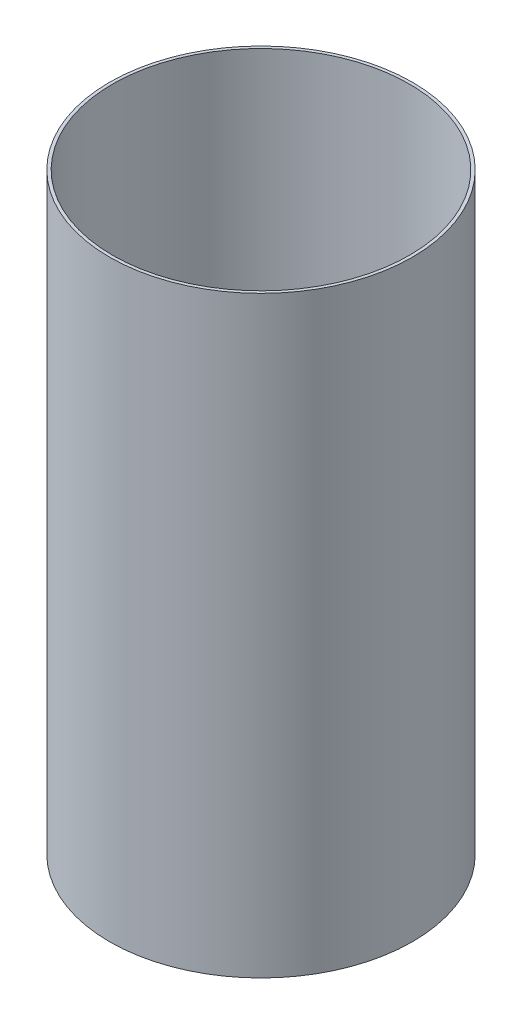
ISO-10303-21;
HEADER;
FILE_DESCRIPTION(('STEP AP214'),'2;1');
FILE_NAME('part.step','',(''),(''),'','','');
FILE_SCHEMA(('AUTOMOTIVE_DESIGN { 1 0 10303 214 1 1 1 1 }'));
ENDSEC;
DATA;
#1=APPLICATION_CONTEXT('core data for automotive mechanical design processes');
#2=APPLICATION_PROTOCOL_DEFINITION('international standard','automotive_design',2000,#1);
#3=PRODUCT_CONTEXT('',#1,'mechanical');
#4=PRODUCT('Part','Part','',(#3));
#5=PRODUCT_RELATED_PRODUCT_CATEGORY('part','',(#4));
#6=PRODUCT_DEFINITION_FORMATION('','',#4);
#7=PRODUCT_DEFINITION_CONTEXT('part definition',#1,'design');
#8=PRODUCT_DEFINITION('design','',#6,#7);
#9=PRODUCT_DEFINITION_SHAPE('','',#8);
#10=(LENGTH_UNIT() NAMED_UNIT(*) SI_UNIT(.MILLI.,.METRE.));
#11=(NAMED_UNIT(*) PLANE_ANGLE_UNIT() SI_UNIT($,.RADIAN.));
#12=(NAMED_UNIT(*) SI_UNIT($,.STERADIAN.) SOLID_ANGLE_UNIT());
#13=UNCERTAINTY_MEASURE_WITH_UNIT(LENGTH_MEASURE(1.E-05),#10,'distance_accuracy_value','');
#14=(GEOMETRIC_REPRESENTATION_CONTEXT(3) GLOBAL_UNCERTAINTY_ASSIGNED_CONTEXT((#13)) GLOBAL_UNIT_ASSIGNED_CONTEXT((#10,
#11,#12)) REPRESENTATION_CONTEXT('',''));
#15=CARTESIAN_POINT('',(0.,0.,0.));
#16=DIRECTION('',(0.,0.,1.));
#17=DIRECTION('',(1.,0.,0.));
#18=AXIS2_PLACEMENT_3D('',#15,#16,#17);
#19=CARTESIAN_POINT('',(0.,304.8,0.));
#20=DIRECTION('',(0.,1.,0.));
#21=DIRECTION('',(0.,0.,1.));
#22=AXIS2_PLACEMENT_3D('',#19,#20,#21);
#23=PLANE('',#22);
#24=CARTESIAN_POINT('',(0.,304.8,0.));
#25=DIRECTION('',(0.,1.,0.));
#26=DIRECTION('',(0.,0.,1.));
#27=AXIS2_PLACEMENT_3D('',#24,#25,#26);
#28=CIRCLE('',#27,77.8637);
#29=CARTESIAN_POINT('',(0.,304.8,77.8637));
#30=VERTEX_POINT('',#29);
#31=EDGE_CURVE('E10',#30,#30,#28,.T.);
#32=ORIENTED_EDGE('',*,*,#31,.T.);
#33=EDGE_LOOP('',(#32));
#34=FACE_BOUND('',#33,.T.);
#35=CARTESIAN_POINT('',(0.,304.8,0.));
#36=DIRECTION('',(0.,1.,0.));
#37=DIRECTION('',(0.,0.,1.));
#38=AXIS2_PLACEMENT_3D('',#35,#36,#37);
#39=CIRCLE('',#38,76.2889);
#40=CARTESIAN_POINT('',(0.,304.8,76.2889));
#41=VERTEX_POINT('',#40);
#42=EDGE_CURVE('E42',#41,#41,#39,.T.);
#43=ORIENTED_EDGE('',*,*,#42,.F.);
#44=EDGE_LOOP('',(#43));
#45=FACE_BOUND('',#44,.T.);
#46=ADVANCED_FACE('F31',(#34,#45),#23,.T.);
#47=CARTESIAN_POINT('',(0.,0.,0.));
#48=DIRECTION('',(0.,1.,0.));
#49=DIRECTION('',(0.,0.,1.));
#50=AXIS2_PLACEMENT_3D('',#47,#48,#49);
#51=PLANE('',#50);
#52=CARTESIAN_POINT('',(0.,0.,0.));
#53=DIRECTION('',(0.,1.,0.));
#54=DIRECTION('',(0.,0.,1.));
#55=AXIS2_PLACEMENT_3D('',#52,#53,#54);
#56=CIRCLE('',#55,77.8637);
#57=CARTESIAN_POINT('',(0.,0.,77.8637));
#58=VERTEX_POINT('',#57);
#59=EDGE_CURVE('E35',#58,#58,#56,.T.);
#60=ORIENTED_EDGE('',*,*,#59,.F.);
#61=EDGE_LOOP('',(#60));
#62=FACE_BOUND('',#61,.T.);
#63=CARTESIAN_POINT('',(0.,0.,0.));
#64=DIRECTION('',(0.,1.,0.));
#65=DIRECTION('',(0.,0.,1.));
#66=AXIS2_PLACEMENT_3D('',#63,#64,#65);
#67=CIRCLE('',#66,76.2889);
#68=CARTESIAN_POINT('',(0.,0.,76.2889));
#69=VERTEX_POINT('',#68);
#70=EDGE_CURVE('E44',#69,#69,#67,.T.);
#71=ORIENTED_EDGE('',*,*,#70,.T.);
#72=EDGE_LOOP('',(#71));
#73=FACE_BOUND('',#72,.T.);
#74=ADVANCED_FACE('F54',(#62,#73),#51,.F.);
#75=CARTESIAN_POINT('',(0.,304.8,0.));
#76=DIRECTION('',(0.,-1.,0.));
#77=DIRECTION('',(0.,0.,-1.));
#78=AXIS2_PLACEMENT_3D('',#75,#76,#77);
#79=CYLINDRICAL_SURFACE('',#78,77.8637);
#80=ORIENTED_EDGE('',*,*,#31,.F.);
#81=EDGE_LOOP('',(#80));
#82=FACE_BOUND('',#81,.T.);
#83=ORIENTED_EDGE('',*,*,#59,.T.);
#84=EDGE_LOOP('',(#83));
#85=FACE_BOUND('',#84,.T.);
#86=ADVANCED_FACE('F33',(#82,#85),#79,.T.);
#87=CARTESIAN_POINT('',(0.,304.8,0.));
#88=DIRECTION('',(0.,-1.,0.));
#89=DIRECTION('',(0.,0.,-1.));
#90=AXIS2_PLACEMENT_3D('',#87,#88,#89);
#91=CYLINDRICAL_SURFACE('',#90,76.2889);
#92=ORIENTED_EDGE('',*,*,#42,.T.);
#93=EDGE_LOOP('',(#92));
#94=FACE_BOUND('',#93,.T.);
#95=ORIENTED_EDGE('',*,*,#70,.F.);
#96=EDGE_LOOP('',(#95));
#97=FACE_BOUND('',#96,.T.);
#98=ADVANCED_FACE('F50',(#94,#97),#91,.F.);
#99=CLOSED_SHELL('',(#46,#74,#86,#98));
#100=MANIFOLD_SOLID_BREP('B2',#99);
#101=ADVANCED_BREP_SHAPE_REPRESENTATION('',(#18,#100),#14);
#102=SHAPE_DEFINITION_REPRESENTATION(#9,#101);
ENDSEC;
END-ISO-10303-21;
